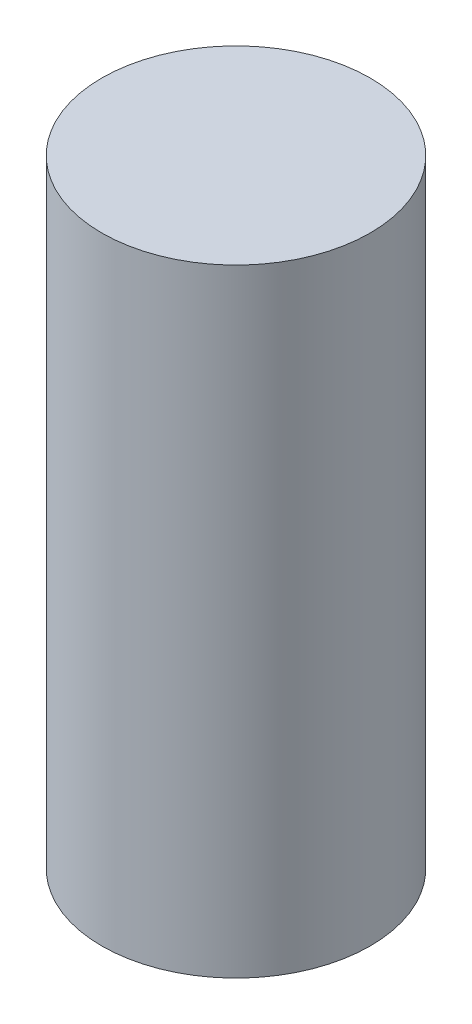
ISO-10303-21;
HEADER;
FILE_DESCRIPTION(('STEP AP214'),'2;1');
FILE_NAME('part.step','',(''),(''),'','','');
FILE_SCHEMA(('AUTOMOTIVE_DESIGN { 1 0 10303 214 1 1 1 1 }'));
ENDSEC;
DATA;
#1=APPLICATION_CONTEXT('core data for automotive mechanical design processes');
#2=APPLICATION_PROTOCOL_DEFINITION('international standard','automotive_design',2000,#1);
#3=PRODUCT_CONTEXT('',#1,'mechanical');
#4=PRODUCT('Part','Part','',(#3));
#5=PRODUCT_RELATED_PRODUCT_CATEGORY('part','',(#4));
#6=PRODUCT_DEFINITION_FORMATION('','',#4);
#7=PRODUCT_DEFINITION_CONTEXT('part definition',#1,'design');
#8=PRODUCT_DEFINITION('design','',#6,#7);
#9=PRODUCT_DEFINITION_SHAPE('','',#8);
#10=(LENGTH_UNIT() NAMED_UNIT(*) SI_UNIT(.MILLI.,.METRE.));
#11=(NAMED_UNIT(*) PLANE_ANGLE_UNIT() SI_UNIT($,.RADIAN.));
#12=(NAMED_UNIT(*) SI_UNIT($,.STERADIAN.) SOLID_ANGLE_UNIT());
#13=UNCERTAINTY_MEASURE_WITH_UNIT(LENGTH_MEASURE(1.E-05),#10,'distance_accuracy_value','');
#14=(GEOMETRIC_REPRESENTATION_CONTEXT(3) GLOBAL_UNCERTAINTY_ASSIGNED_CONTEXT((#13)) GLOBAL_UNIT_ASSIGNED_CONTEXT((#10,
#11,#12)) REPRESENTATION_CONTEXT('',''));
#15=CARTESIAN_POINT('',(0.,0.,0.));
#16=DIRECTION('',(0.,0.,1.));
#17=DIRECTION('',(1.,0.,0.));
#18=AXIS2_PLACEMENT_3D('',#15,#16,#17);
#19=CARTESIAN_POINT('',(0.,46.,0.));
#20=DIRECTION('',(0.,-1.,0.));
#21=DIRECTION('',(0.,0.,-1.));
#22=AXIS2_PLACEMENT_3D('',#19,#20,#21);
#23=CYLINDRICAL_SURFACE('',#22,10.);
#24=CARTESIAN_POINT('',(0.,46.,0.));
#25=DIRECTION('',(0.,1.,0.));
#26=DIRECTION('',(0.,0.,1.));
#27=AXIS2_PLACEMENT_3D('',#24,#25,#26);
#28=CIRCLE('',#27,10.);
#29=CARTESIAN_POINT('',(0.,46.,10.));
#30=VERTEX_POINT('',#29);
#31=EDGE_CURVE('E10',#30,#30,#28,.T.);
#32=ORIENTED_EDGE('',*,*,#31,.F.);
#33=EDGE_LOOP('',(#32));
#34=FACE_BOUND('',#33,.T.);
#35=CARTESIAN_POINT('',(0.,0.,0.));
#36=DIRECTION('',(0.,1.,0.));
#37=DIRECTION('',(0.,0.,1.));
#38=AXIS2_PLACEMENT_3D('',#35,#36,#37);
#39=CIRCLE('',#38,10.);
#40=CARTESIAN_POINT('',(0.,0.,10.));
#41=VERTEX_POINT('',#40);
#42=EDGE_CURVE('E46',#41,#41,#39,.T.);
#43=ORIENTED_EDGE('',*,*,#42,.T.);
#44=EDGE_LOOP('',(#43));
#45=FACE_BOUND('',#44,.T.);
#46=ADVANCED_FACE('F43',(#34,#45),#23,.T.);
#47=CARTESIAN_POINT('',(0.,46.,0.));
#48=DIRECTION('',(0.,1.,0.));
#49=DIRECTION('',(0.,0.,1.));
#50=AXIS2_PLACEMENT_3D('',#47,#48,#49);
#51=PLANE('',#50);
#52=ORIENTED_EDGE('',*,*,#31,.T.);
#53=EDGE_LOOP('',(#52));
#54=FACE_BOUND('',#53,.T.);
#55=ADVANCED_FACE('F58',(#54),#51,.T.);
#56=CARTESIAN_POINT('',(0.,0.,0.));
#57=DIRECTION('',(0.,1.,0.));
#58=DIRECTION('',(0.,0.,1.));
#59=AXIS2_PLACEMENT_3D('',#56,#57,#58);
#60=PLANE('',#59);
#61=ORIENTED_EDGE('',*,*,#42,.F.);
#62=EDGE_LOOP('',(#61));
#63=FACE_BOUND('',#62,.T.);
#64=ADVANCED_FACE('F56',(#63),#60,.F.);
#65=CLOSED_SHELL('',(#46,#55,#64));
#66=MANIFOLD_SOLID_BREP('B2',#65);
#67=ADVANCED_BREP_SHAPE_REPRESENTATION('',(#18,#66),#14);
#68=SHAPE_DEFINITION_REPRESENTATION(#9,#67);
ENDSEC;
END-ISO-10303-21;
